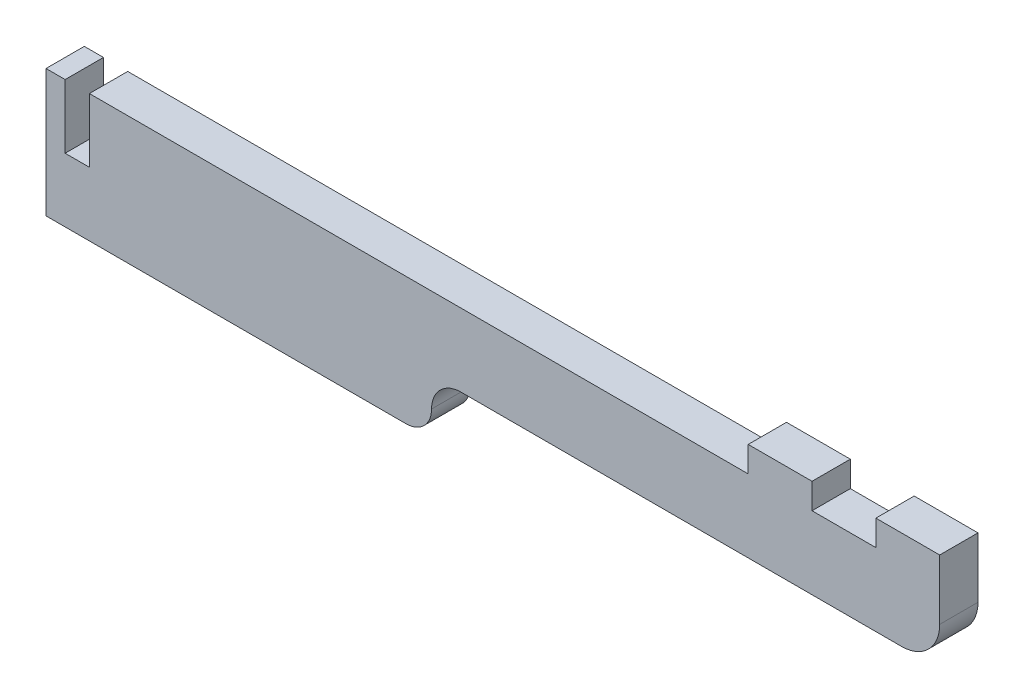
ISO-10303-21;
HEADER;
FILE_DESCRIPTION(('STEP AP214'),'2;1');
FILE_NAME('part.step','',(''),(''),'','','');
FILE_SCHEMA(('AUTOMOTIVE_DESIGN { 1 0 10303 214 1 1 1 1 }'));
ENDSEC;
DATA;
#1=APPLICATION_CONTEXT('core data for automotive mechanical design processes');
#2=APPLICATION_PROTOCOL_DEFINITION('international standard','automotive_design',2000,#1);
#3=PRODUCT_CONTEXT('',#1,'mechanical');
#4=PRODUCT('Part','Part','',(#3));
#5=PRODUCT_RELATED_PRODUCT_CATEGORY('part','',(#4));
#6=PRODUCT_DEFINITION_FORMATION('','',#4);
#7=PRODUCT_DEFINITION_CONTEXT('part definition',#1,'design');
#8=PRODUCT_DEFINITION('design','',#6,#7);
#9=PRODUCT_DEFINITION_SHAPE('','',#8);
#10=(LENGTH_UNIT() NAMED_UNIT(*) SI_UNIT(.MILLI.,.METRE.));
#11=(NAMED_UNIT(*) PLANE_ANGLE_UNIT() SI_UNIT($,.RADIAN.));
#12=(NAMED_UNIT(*) SI_UNIT($,.STERADIAN.) SOLID_ANGLE_UNIT());
#13=UNCERTAINTY_MEASURE_WITH_UNIT(LENGTH_MEASURE(1.E-05),#10,'distance_accuracy_value','');
#14=(GEOMETRIC_REPRESENTATION_CONTEXT(3) GLOBAL_UNCERTAINTY_ASSIGNED_CONTEXT((#13)) GLOBAL_UNIT_ASSIGNED_CONTEXT((#10,
#11,#12)) REPRESENTATION_CONTEXT('',''));
#15=CARTESIAN_POINT('',(0.,0.,0.));
#16=DIRECTION('',(0.,0.,1.));
#17=DIRECTION('',(1.,0.,0.));
#18=AXIS2_PLACEMENT_3D('',#15,#16,#17);
#19=CARTESIAN_POINT('',(0.,0.,6.));
#20=DIRECTION('',(0.,1.,0.));
#21=DIRECTION('',(0.,0.,1.));
#22=AXIS2_PLACEMENT_3D('',#19,#20,#21);
#23=PLANE('',#22);
#24=DIRECTION('',(0.,0.,1.));
#25=VECTOR('',#24,1.);
#26=CARTESIAN_POINT('',(56.4,0.,-0.00100000000000013));
#27=LINE('',#26,#25);
#28=CARTESIAN_POINT('',(56.4,0.,0.));
#29=VERTEX_POINT('',#28);
#30=CARTESIAN_POINT('',(56.4,0.,6.));
#31=VERTEX_POINT('',#30);
#32=EDGE_CURVE('E174',#29,#31,#27,.T.);
#33=ORIENTED_EDGE('',*,*,#32,.T.);
#34=DIRECTION('',(1.,0.,0.));
#35=VECTOR('',#34,1.);
#36=CARTESIAN_POINT('',(0.,0.,6.));
#37=LINE('',#36,#35);
#38=CARTESIAN_POINT('',(0.,0.,6.));
#39=VERTEX_POINT('',#38);
#40=EDGE_CURVE('E212',#39,#31,#37,.T.);
#41=ORIENTED_EDGE('',*,*,#40,.F.);
#42=DIRECTION('',(0.,0.,-1.));
#43=VECTOR('',#42,1.);
#44=CARTESIAN_POINT('',(0.,0.,6.));
#45=LINE('',#44,#43);
#46=CARTESIAN_POINT('',(0.,0.,0.));
#47=VERTEX_POINT('',#46);
#48=EDGE_CURVE('E11',#39,#47,#45,.T.);
#49=ORIENTED_EDGE('',*,*,#48,.T.);
#50=DIRECTION('',(1.,0.,0.));
#51=VECTOR('',#50,1.);
#52=CARTESIAN_POINT('',(0.,0.,0.));
#53=LINE('',#52,#51);
#54=EDGE_CURVE('E183',#47,#29,#53,.T.);
#55=ORIENTED_EDGE('',*,*,#54,.T.);
#56=EDGE_LOOP('',(#33,#41,#49,#55));
#57=FACE_BOUND('',#56,.T.);
#58=ADVANCED_FACE('F33',(#57),#23,.F.);
#59=CARTESIAN_POINT('',(0.,20.,6.));
#60=DIRECTION('',(0.,-1.,0.));
#61=DIRECTION('',(0.,0.,-1.));
#62=AXIS2_PLACEMENT_3D('',#59,#60,#61);
#63=PLANE('',#62);
#64=DIRECTION('',(-1.,0.,0.));
#65=VECTOR('',#64,1.);
#66=CARTESIAN_POINT('',(0.,20.,6.));
#67=LINE('',#66,#65);
#68=CARTESIAN_POINT('',(3.,20.,6.));
#69=VERTEX_POINT('',#68);
#70=CARTESIAN_POINT('',(0.,20.,6.));
#71=VERTEX_POINT('',#70);
#72=EDGE_CURVE('E203',#69,#71,#67,.T.);
#73=ORIENTED_EDGE('',*,*,#72,.F.);
#74=DIRECTION('',(0.,0.,-1.));
#75=VECTOR('',#74,1.);
#76=CARTESIAN_POINT('',(3.,20.,6.001));
#77=LINE('',#76,#75);
#78=CARTESIAN_POINT('',(3.,20.,0.));
#79=VERTEX_POINT('',#78);
#80=EDGE_CURVE('E260',#69,#79,#77,.T.);
#81=ORIENTED_EDGE('',*,*,#80,.T.);
#82=DIRECTION('',(-1.,0.,0.));
#83=VECTOR('',#82,1.);
#84=CARTESIAN_POINT('',(0.,20.,0.));
#85=LINE('',#84,#83);
#86=CARTESIAN_POINT('',(0.,20.,0.));
#87=VERTEX_POINT('',#86);
#88=EDGE_CURVE('E182',#79,#87,#85,.T.);
#89=ORIENTED_EDGE('',*,*,#88,.T.);
#90=DIRECTION('',(0.,0.,-1.));
#91=VECTOR('',#90,1.);
#92=CARTESIAN_POINT('',(0.,20.,6.));
#93=LINE('',#92,#91);
#94=EDGE_CURVE('E41',#71,#87,#93,.T.);
#95=ORIENTED_EDGE('',*,*,#94,.F.);
#96=EDGE_LOOP('',(#73,#81,#89,#95));
#97=FACE_BOUND('',#96,.T.);
#98=ADVANCED_FACE('F320',(#97),#63,.F.);
#99=CARTESIAN_POINT('',(130.,20.,0.));
#100=VERTEX_POINT('',#99);
#101=CARTESIAN_POINT('',(120.,20.,0.));
#102=VERTEX_POINT('',#101);
#103=EDGE_CURVE('E187',#100,#102,#85,.T.);
#104=ORIENTED_EDGE('',*,*,#103,.T.);
#105=DIRECTION('',(0.,0.,-1.));
#106=VECTOR('',#105,1.);
#107=CARTESIAN_POINT('',(120.,20.,16.770329614269));
#108=LINE('',#107,#106);
#109=CARTESIAN_POINT('',(120.,20.,6.));
#110=VERTEX_POINT('',#109);
#111=EDGE_CURVE('E233',#110,#102,#108,.T.);
#112=ORIENTED_EDGE('',*,*,#111,.F.);
#113=CARTESIAN_POINT('',(130.,20.,6.));
#114=VERTEX_POINT('',#113);
#115=EDGE_CURVE('E194',#114,#110,#67,.T.);
#116=ORIENTED_EDGE('',*,*,#115,.F.);
#117=DIRECTION('',(0.,0.,-1.));
#118=VECTOR('',#117,1.);
#119=CARTESIAN_POINT('',(130.,20.,16.770329614269));
#120=LINE('',#119,#118);
#121=EDGE_CURVE('E218',#114,#100,#120,.T.);
#122=ORIENTED_EDGE('',*,*,#121,.T.);
#123=EDGE_LOOP('',(#104,#112,#116,#122));
#124=FACE_BOUND('',#123,.T.);
#125=ADVANCED_FACE('F347',(#124),#63,.F.);
#126=CARTESIAN_POINT('',(0.,0.,6.));
#127=DIRECTION('',(1.,0.,0.));
#128=DIRECTION('',(0.,0.,-1.));
#129=AXIS2_PLACEMENT_3D('',#126,#127,#128);
#130=PLANE('',#129);
#131=DIRECTION('',(0.,-1.,0.));
#132=VECTOR('',#131,1.);
#133=CARTESIAN_POINT('',(0.,0.,0.));
#134=LINE('',#133,#132);
#135=EDGE_CURVE('E189',#87,#47,#134,.T.);
#136=ORIENTED_EDGE('',*,*,#135,.T.);
#137=ORIENTED_EDGE('',*,*,#48,.F.);
#138=DIRECTION('',(0.,-1.,0.));
#139=VECTOR('',#138,1.);
#140=CARTESIAN_POINT('',(0.,0.,6.));
#141=LINE('',#140,#139);
#142=EDGE_CURVE('E192',#71,#39,#141,.T.);
#143=ORIENTED_EDGE('',*,*,#142,.F.);
#144=ORIENTED_EDGE('',*,*,#94,.T.);
#145=EDGE_LOOP('',(#136,#137,#143,#144));
#146=FACE_BOUND('',#145,.T.);
#147=ADVANCED_FACE('F35',(#146),#130,.F.);
#148=CARTESIAN_POINT('',(140.,0.,6.));
#149=DIRECTION('',(-1.,0.,0.));
#150=DIRECTION('',(0.,0.,1.));
#151=AXIS2_PLACEMENT_3D('',#148,#149,#150);
#152=PLANE('',#151);
#153=DIRECTION('',(0.,1.,0.));
#154=VECTOR('',#153,1.);
#155=CARTESIAN_POINT('',(140.,0.,6.));
#156=LINE('',#155,#154);
#157=CARTESIAN_POINT('',(140.,14.5842325695984,6.));
#158=VERTEX_POINT('',#157);
#159=CARTESIAN_POINT('',(140.,24.,6.));
#160=VERTEX_POINT('',#159);
#161=EDGE_CURVE('E173',#158,#160,#156,.T.);
#162=ORIENTED_EDGE('',*,*,#161,.F.);
#163=DIRECTION('',(0.,0.,1.));
#164=VECTOR('',#163,1.);
#165=CARTESIAN_POINT('',(140.,14.5842325695984,-0.00100000000000013));
#166=LINE('',#165,#164);
#167=CARTESIAN_POINT('',(140.,14.5842325695984,0.));
#168=VERTEX_POINT('',#167);
#169=EDGE_CURVE('E160',#168,#158,#166,.T.);
#170=ORIENTED_EDGE('',*,*,#169,.F.);
#171=DIRECTION('',(0.,1.,0.));
#172=VECTOR('',#171,1.);
#173=CARTESIAN_POINT('',(140.,0.,0.));
#174=LINE('',#173,#172);
#175=CARTESIAN_POINT('',(140.,24.,0.));
#176=VERTEX_POINT('',#175);
#177=EDGE_CURVE('E171',#168,#176,#174,.T.);
#178=ORIENTED_EDGE('',*,*,#177,.T.);
#179=DIRECTION('',(0.,0.,-1.));
#180=VECTOR('',#179,1.);
#181=CARTESIAN_POINT('',(140.,24.,16.770329614269));
#182=LINE('',#181,#180);
#183=EDGE_CURVE('E223',#160,#176,#182,.T.);
#184=ORIENTED_EDGE('',*,*,#183,.F.);
#185=EDGE_LOOP('',(#162,#170,#178,#184));
#186=FACE_BOUND('',#185,.T.);
#187=ADVANCED_FACE('F169',(#186),#152,.F.);
#188=CARTESIAN_POINT('',(110.,20.,0.));
#189=VERTEX_POINT('',#188);
#190=CARTESIAN_POINT('',(6.8,20.,0.));
#191=VERTEX_POINT('',#190);
#192=EDGE_CURVE('E185',#189,#191,#85,.T.);
#193=ORIENTED_EDGE('',*,*,#192,.T.);
#194=DIRECTION('',(0.,0.,-1.));
#195=VECTOR('',#194,1.);
#196=CARTESIAN_POINT('',(6.8,20.,6.001));
#197=LINE('',#196,#195);
#198=CARTESIAN_POINT('',(6.8,20.,6.));
#199=VERTEX_POINT('',#198);
#200=EDGE_CURVE('E56',#199,#191,#197,.T.);
#201=ORIENTED_EDGE('',*,*,#200,.F.);
#202=CARTESIAN_POINT('',(110.,20.,6.));
#203=VERTEX_POINT('',#202);
#204=EDGE_CURVE('E201',#203,#199,#67,.T.);
#205=ORIENTED_EDGE('',*,*,#204,.F.);
#206=DIRECTION('',(0.,0.,-1.));
#207=VECTOR('',#206,1.);
#208=CARTESIAN_POINT('',(110.,20.,16.770329614269));
#209=LINE('',#208,#207);
#210=EDGE_CURVE('E236',#203,#189,#209,.T.);
#211=ORIENTED_EDGE('',*,*,#210,.T.);
#212=EDGE_LOOP('',(#193,#201,#205,#211));
#213=FACE_BOUND('',#212,.T.);
#214=ADVANCED_FACE('F330',(#213),#63,.F.);
#215=CARTESIAN_POINT('',(0.,0.,6.));
#216=DIRECTION('',(0.,0.,-1.));
#217=DIRECTION('',(-1.,0.,0.));
#218=AXIS2_PLACEMENT_3D('',#215,#216,#217);
#219=PLANE('',#218);
#220=ORIENTED_EDGE('',*,*,#40,.T.);
#221=CARTESIAN_POINT('',(56.4,4.,6.));
#222=DIRECTION('',(0.,0.,-1.));
#223=DIRECTION('',(1.,0.,0.));
#224=AXIS2_PLACEMENT_3D('',#221,#222,#223);
#225=CIRCLE('',#224,4.);
#226=CARTESIAN_POINT('',(60.4,4.,6.));
#227=VERTEX_POINT('',#226);
#228=EDGE_CURVE('E296',#227,#31,#225,.T.);
#229=ORIENTED_EDGE('',*,*,#228,.F.);
#230=CARTESIAN_POINT('',(65.,4.,6.));
#231=DIRECTION('',(0.,0.,1.));
#232=DIRECTION('',(-1.,0.,0.));
#233=AXIS2_PLACEMENT_3D('',#230,#231,#232);
#234=CIRCLE('',#233,4.59999999999999);
#235=CARTESIAN_POINT('',(65.,8.59999999999999,6.));
#236=VERTEX_POINT('',#235);
#237=EDGE_CURVE('E283',#236,#227,#234,.T.);
#238=ORIENTED_EDGE('',*,*,#237,.F.);
#239=DIRECTION('',(-1.,0.,0.));
#240=VECTOR('',#239,1.);
#241=CARTESIAN_POINT('',(134.015767430402,8.6,6.));
#242=LINE('',#241,#240);
#243=CARTESIAN_POINT('',(134.015767430402,8.6,6.));
#244=VERTEX_POINT('',#243);
#245=EDGE_CURVE('E291',#244,#236,#242,.T.);
#246=ORIENTED_EDGE('',*,*,#245,.F.);
#247=CARTESIAN_POINT('',(134.015767430402,14.5842325695984,6.));
#248=DIRECTION('',(0.,0.,-1.));
#249=DIRECTION('',(1.,0.,0.));
#250=AXIS2_PLACEMENT_3D('',#247,#248,#249);
#251=CIRCLE('',#250,5.9842325695984);
#252=EDGE_CURVE('E294',#158,#244,#251,.T.);
#253=ORIENTED_EDGE('',*,*,#252,.F.);
#254=ORIENTED_EDGE('',*,*,#161,.T.);
#255=DIRECTION('',(-1.,0.,0.));
#256=VECTOR('',#255,1.);
#257=CARTESIAN_POINT('',(140.,24.,6.));
#258=LINE('',#257,#256);
#259=CARTESIAN_POINT('',(130.,24.,6.));
#260=VERTEX_POINT('',#259);
#261=EDGE_CURVE('E230',#160,#260,#258,.T.);
#262=ORIENTED_EDGE('',*,*,#261,.T.);
#263=DIRECTION('',(0.,-1.,0.));
#264=VECTOR('',#263,1.);
#265=CARTESIAN_POINT('',(130.,20.,6.));
#266=LINE('',#265,#264);
#267=EDGE_CURVE('E225',#260,#114,#266,.T.);
#268=ORIENTED_EDGE('',*,*,#267,.T.);
#269=ORIENTED_EDGE('',*,*,#115,.T.);
#270=DIRECTION('',(0.,1.,0.));
#271=VECTOR('',#270,1.);
#272=CARTESIAN_POINT('',(120.,20.,6.));
#273=LINE('',#272,#271);
#274=CARTESIAN_POINT('',(120.,24.,6.));
#275=VERTEX_POINT('',#274);
#276=EDGE_CURVE('E229',#110,#275,#273,.T.);
#277=ORIENTED_EDGE('',*,*,#276,.T.);
#278=DIRECTION('',(-1.,0.,0.));
#279=VECTOR('',#278,1.);
#280=CARTESIAN_POINT('',(120.,24.,6.));
#281=LINE('',#280,#279);
#282=CARTESIAN_POINT('',(110.,24.,6.));
#283=VERTEX_POINT('',#282);
#284=EDGE_CURVE('E255',#275,#283,#281,.T.);
#285=ORIENTED_EDGE('',*,*,#284,.T.);
#286=DIRECTION('',(0.,-1.,0.));
#287=VECTOR('',#286,1.);
#288=CARTESIAN_POINT('',(110.,20.,6.));
#289=LINE('',#288,#287);
#290=EDGE_CURVE('E244',#283,#203,#289,.T.);
#291=ORIENTED_EDGE('',*,*,#290,.T.);
#292=ORIENTED_EDGE('',*,*,#204,.T.);
#293=DIRECTION('',(0.,1.,0.));
#294=VECTOR('',#293,1.);
#295=CARTESIAN_POINT('',(6.8,10.,6.));
#296=LINE('',#295,#294);
#297=CARTESIAN_POINT('',(6.8,10.,6.));
#298=VERTEX_POINT('',#297);
#299=EDGE_CURVE('E253',#298,#199,#296,.T.);
#300=ORIENTED_EDGE('',*,*,#299,.F.);
#301=DIRECTION('',(1.,0.,0.));
#302=VECTOR('',#301,1.);
#303=CARTESIAN_POINT('',(3.,10.,6.));
#304=LINE('',#303,#302);
#305=CARTESIAN_POINT('',(3.,10.,6.));
#306=VERTEX_POINT('',#305);
#307=EDGE_CURVE('E278',#306,#298,#304,.T.);
#308=ORIENTED_EDGE('',*,*,#307,.F.);
#309=DIRECTION('',(0.,-1.,0.));
#310=VECTOR('',#309,1.);
#311=CARTESIAN_POINT('',(3.,20.,6.));
#312=LINE('',#311,#310);
#313=EDGE_CURVE('E275',#69,#306,#312,.T.);
#314=ORIENTED_EDGE('',*,*,#313,.F.);
#315=ORIENTED_EDGE('',*,*,#72,.T.);
#316=ORIENTED_EDGE('',*,*,#142,.T.);
#317=EDGE_LOOP('',(#220,#229,#238,#246,#253,#254,#262,#268,#269,#277,#285,#291,#292,#300,#308,
#314,#315,#316));
#318=FACE_BOUND('',#317,.T.);
#319=ADVANCED_FACE('F324',(#318),#219,.F.);
#320=CARTESIAN_POINT('',(0.,0.,0.));
#321=DIRECTION('',(0.,0.,-1.));
#322=DIRECTION('',(-1.,0.,0.));
#323=AXIS2_PLACEMENT_3D('',#320,#321,#322);
#324=PLANE('',#323);
#325=CARTESIAN_POINT('',(56.4,4.,0.));
#326=DIRECTION('',(0.,0.,-1.));
#327=DIRECTION('',(-1.,0.,0.));
#328=AXIS2_PLACEMENT_3D('',#325,#326,#327);
#329=CIRCLE('',#328,4.);
#330=CARTESIAN_POINT('',(60.4,4.,0.));
#331=VERTEX_POINT('',#330);
#332=EDGE_CURVE('E298',#331,#29,#329,.T.);
#333=ORIENTED_EDGE('',*,*,#332,.T.);
#334=ORIENTED_EDGE('',*,*,#54,.F.);
#335=ORIENTED_EDGE('',*,*,#135,.F.);
#336=ORIENTED_EDGE('',*,*,#88,.F.);
#337=DIRECTION('',(0.,1.,0.));
#338=VECTOR('',#337,1.);
#339=CARTESIAN_POINT('',(3.,20.,0.));
#340=LINE('',#339,#338);
#341=CARTESIAN_POINT('',(3.,10.,0.));
#342=VERTEX_POINT('',#341);
#343=EDGE_CURVE('E263',#342,#79,#340,.T.);
#344=ORIENTED_EDGE('',*,*,#343,.F.);
#345=DIRECTION('',(-1.,0.,0.));
#346=VECTOR('',#345,1.);
#347=CARTESIAN_POINT('',(3.,10.,0.));
#348=LINE('',#347,#346);
#349=CARTESIAN_POINT('',(6.8,10.,0.));
#350=VERTEX_POINT('',#349);
#351=EDGE_CURVE('E270',#350,#342,#348,.T.);
#352=ORIENTED_EDGE('',*,*,#351,.F.);
#353=DIRECTION('',(0.,-1.,0.));
#354=VECTOR('',#353,1.);
#355=CARTESIAN_POINT('',(6.8,10.,0.));
#356=LINE('',#355,#354);
#357=EDGE_CURVE('E273',#191,#350,#356,.T.);
#358=ORIENTED_EDGE('',*,*,#357,.F.);
#359=ORIENTED_EDGE('',*,*,#192,.F.);
#360=DIRECTION('',(0.,1.,0.));
#361=VECTOR('',#360,1.);
#362=CARTESIAN_POINT('',(110.,20.,0.));
#363=LINE('',#362,#361);
#364=CARTESIAN_POINT('',(110.,24.,0.));
#365=VERTEX_POINT('',#364);
#366=EDGE_CURVE('E247',#189,#365,#363,.T.);
#367=ORIENTED_EDGE('',*,*,#366,.T.);
#368=DIRECTION('',(1.,0.,0.));
#369=VECTOR('',#368,1.);
#370=CARTESIAN_POINT('',(120.,24.,0.));
#371=LINE('',#370,#369);
#372=CARTESIAN_POINT('',(120.,24.,0.));
#373=VERTEX_POINT('',#372);
#374=EDGE_CURVE('E237',#365,#373,#371,.T.);
#375=ORIENTED_EDGE('',*,*,#374,.T.);
#376=DIRECTION('',(0.,-1.,0.));
#377=VECTOR('',#376,1.);
#378=CARTESIAN_POINT('',(120.,20.,0.));
#379=LINE('',#378,#377);
#380=EDGE_CURVE('E250',#373,#102,#379,.T.);
#381=ORIENTED_EDGE('',*,*,#380,.T.);
#382=ORIENTED_EDGE('',*,*,#103,.F.);
#383=DIRECTION('',(0.,1.,0.));
#384=VECTOR('',#383,1.);
#385=CARTESIAN_POINT('',(130.,20.,0.));
#386=LINE('',#385,#384);
#387=CARTESIAN_POINT('',(130.,24.,0.));
#388=VERTEX_POINT('',#387);
#389=EDGE_CURVE('E227',#100,#388,#386,.T.);
#390=ORIENTED_EDGE('',*,*,#389,.T.);
#391=DIRECTION('',(1.,0.,0.));
#392=VECTOR('',#391,1.);
#393=CARTESIAN_POINT('',(140.,24.,0.));
#394=LINE('',#393,#392);
#395=EDGE_CURVE('E181',#388,#176,#394,.T.);
#396=ORIENTED_EDGE('',*,*,#395,.T.);
#397=ORIENTED_EDGE('',*,*,#177,.F.);
#398=CARTESIAN_POINT('',(134.015767430402,14.5842325695984,0.));
#399=DIRECTION('',(0.,0.,-1.));
#400=DIRECTION('',(-1.,0.,0.));
#401=AXIS2_PLACEMENT_3D('',#398,#399,#400);
#402=CIRCLE('',#401,5.9842325695984);
#403=CARTESIAN_POINT('',(134.015767430402,8.6,0.));
#404=VERTEX_POINT('',#403);
#405=EDGE_CURVE('E157',#168,#404,#402,.T.);
#406=ORIENTED_EDGE('',*,*,#405,.T.);
#407=DIRECTION('',(-1.,0.,0.));
#408=VECTOR('',#407,1.);
#409=CARTESIAN_POINT('',(134.015767430402,8.6,0.));
#410=LINE('',#409,#408);
#411=CARTESIAN_POINT('',(65.,8.59999999999999,0.));
#412=VERTEX_POINT('',#411);
#413=EDGE_CURVE('E165',#404,#412,#410,.T.);
#414=ORIENTED_EDGE('',*,*,#413,.T.);
#415=CARTESIAN_POINT('',(65.,4.,0.));
#416=DIRECTION('',(0.,0.,-1.));
#417=DIRECTION('',(-1.,0.,0.));
#418=AXIS2_PLACEMENT_3D('',#415,#416,#417);
#419=CIRCLE('',#418,4.59999999999999);
#420=EDGE_CURVE('E300',#412,#331,#419,.F.);
#421=ORIENTED_EDGE('',*,*,#420,.T.);
#422=EDGE_LOOP('',(#333,#334,#335,#336,#344,#352,#358,#359,#367,#375,#381,#382,#390,#396,#397,
#406,#414,#421));
#423=FACE_BOUND('',#422,.T.);
#424=ADVANCED_FACE('F178',(#423),#324,.T.);
#425=CARTESIAN_POINT('',(140.,24.,16.770329614269));
#426=DIRECTION('',(0.,1.,0.));
#427=DIRECTION('',(0.,0.,1.));
#428=AXIS2_PLACEMENT_3D('',#425,#426,#427);
#429=PLANE('',#428);
#430=ORIENTED_EDGE('',*,*,#261,.F.);
#431=ORIENTED_EDGE('',*,*,#183,.T.);
#432=ORIENTED_EDGE('',*,*,#395,.F.);
#433=DIRECTION('',(0.,0.,-1.));
#434=VECTOR('',#433,1.);
#435=CARTESIAN_POINT('',(130.,24.,16.770329614269));
#436=LINE('',#435,#434);
#437=EDGE_CURVE('E221',#260,#388,#436,.T.);
#438=ORIENTED_EDGE('',*,*,#437,.F.);
#439=EDGE_LOOP('',(#430,#431,#432,#438));
#440=FACE_BOUND('',#439,.T.);
#441=ADVANCED_FACE('F354',(#440),#429,.T.);
#442=CARTESIAN_POINT('',(130.,20.,16.770329614269));
#443=DIRECTION('',(-1.,0.,0.));
#444=DIRECTION('',(0.,0.,1.));
#445=AXIS2_PLACEMENT_3D('',#442,#443,#444);
#446=PLANE('',#445);
#447=ORIENTED_EDGE('',*,*,#267,.F.);
#448=ORIENTED_EDGE('',*,*,#437,.T.);
#449=ORIENTED_EDGE('',*,*,#389,.F.);
#450=ORIENTED_EDGE('',*,*,#121,.F.);
#451=EDGE_LOOP('',(#447,#448,#449,#450));
#452=FACE_BOUND('',#451,.T.);
#453=ADVANCED_FACE('F351',(#452),#446,.T.);
#454=CARTESIAN_POINT('',(120.,20.,16.770329614269));
#455=DIRECTION('',(1.,0.,0.));
#456=DIRECTION('',(0.,0.,-1.));
#457=AXIS2_PLACEMENT_3D('',#454,#455,#456);
#458=PLANE('',#457);
#459=ORIENTED_EDGE('',*,*,#276,.F.);
#460=ORIENTED_EDGE('',*,*,#111,.T.);
#461=ORIENTED_EDGE('',*,*,#380,.F.);
#462=DIRECTION('',(0.,0.,-1.));
#463=VECTOR('',#462,1.);
#464=CARTESIAN_POINT('',(120.,24.,16.770329614269));
#465=LINE('',#464,#463);
#466=EDGE_CURVE('E242',#275,#373,#465,.T.);
#467=ORIENTED_EDGE('',*,*,#466,.F.);
#468=EDGE_LOOP('',(#459,#460,#461,#467));
#469=FACE_BOUND('',#468,.T.);
#470=ADVANCED_FACE('F344',(#469),#458,.T.);
#471=CARTESIAN_POINT('',(120.,24.,16.770329614269));
#472=DIRECTION('',(0.,1.,0.));
#473=DIRECTION('',(0.,0.,1.));
#474=AXIS2_PLACEMENT_3D('',#471,#472,#473);
#475=PLANE('',#474);
#476=ORIENTED_EDGE('',*,*,#284,.F.);
#477=ORIENTED_EDGE('',*,*,#466,.T.);
#478=ORIENTED_EDGE('',*,*,#374,.F.);
#479=DIRECTION('',(0.,0.,-1.));
#480=VECTOR('',#479,1.);
#481=CARTESIAN_POINT('',(110.,24.,16.770329614269));
#482=LINE('',#481,#480);
#483=EDGE_CURVE('E240',#283,#365,#482,.T.);
#484=ORIENTED_EDGE('',*,*,#483,.F.);
#485=EDGE_LOOP('',(#476,#477,#478,#484));
#486=FACE_BOUND('',#485,.T.);
#487=ADVANCED_FACE('F340',(#486),#475,.T.);
#488=CARTESIAN_POINT('',(110.,20.,16.770329614269));
#489=DIRECTION('',(-1.,0.,0.));
#490=DIRECTION('',(0.,0.,1.));
#491=AXIS2_PLACEMENT_3D('',#488,#489,#490);
#492=PLANE('',#491);
#493=ORIENTED_EDGE('',*,*,#290,.F.);
#494=ORIENTED_EDGE('',*,*,#483,.T.);
#495=ORIENTED_EDGE('',*,*,#366,.F.);
#496=ORIENTED_EDGE('',*,*,#210,.F.);
#497=EDGE_LOOP('',(#493,#494,#495,#496));
#498=FACE_BOUND('',#497,.T.);
#499=ADVANCED_FACE('F335',(#498),#492,.T.);
#500=CARTESIAN_POINT('',(3.,20.,6.001));
#501=DIRECTION('',(-1.,0.,0.));
#502=DIRECTION('',(0.,-1.,0.));
#503=AXIS2_PLACEMENT_3D('',#500,#501,#502);
#504=PLANE('',#503);
#505=ORIENTED_EDGE('',*,*,#313,.T.);
#506=DIRECTION('',(0.,0.,-1.));
#507=VECTOR('',#506,1.);
#508=CARTESIAN_POINT('',(3.,10.,6.001));
#509=LINE('',#508,#507);
#510=EDGE_CURVE('E265',#306,#342,#509,.T.);
#511=ORIENTED_EDGE('',*,*,#510,.T.);
#512=ORIENTED_EDGE('',*,*,#343,.T.);
#513=ORIENTED_EDGE('',*,*,#80,.F.);
#514=EDGE_LOOP('',(#505,#511,#512,#513));
#515=FACE_BOUND('',#514,.T.);
#516=ADVANCED_FACE('F322',(#515),#504,.F.);
#517=CARTESIAN_POINT('',(3.,10.,6.001));
#518=DIRECTION('',(0.,-1.,0.));
#519=DIRECTION('',(1.,0.,0.));
#520=AXIS2_PLACEMENT_3D('',#517,#518,#519);
#521=PLANE('',#520);
#522=ORIENTED_EDGE('',*,*,#307,.T.);
#523=DIRECTION('',(0.,0.,-1.));
#524=VECTOR('',#523,1.);
#525=CARTESIAN_POINT('',(6.8,10.,6.001));
#526=LINE('',#525,#524);
#527=EDGE_CURVE('E262',#298,#350,#526,.T.);
#528=ORIENTED_EDGE('',*,*,#527,.T.);
#529=ORIENTED_EDGE('',*,*,#351,.T.);
#530=ORIENTED_EDGE('',*,*,#510,.F.);
#531=EDGE_LOOP('',(#522,#528,#529,#530));
#532=FACE_BOUND('',#531,.T.);
#533=ADVANCED_FACE('F327',(#532),#521,.F.);
#534=CARTESIAN_POINT('',(6.8,10.,6.001));
#535=DIRECTION('',(1.,0.,0.));
#536=DIRECTION('',(0.,1.,0.));
#537=AXIS2_PLACEMENT_3D('',#534,#535,#536);
#538=PLANE('',#537);
#539=ORIENTED_EDGE('',*,*,#299,.T.);
#540=ORIENTED_EDGE('',*,*,#200,.T.);
#541=ORIENTED_EDGE('',*,*,#357,.T.);
#542=ORIENTED_EDGE('',*,*,#527,.F.);
#543=EDGE_LOOP('',(#539,#540,#541,#542));
#544=FACE_BOUND('',#543,.T.);
#545=ADVANCED_FACE('F394',(#544),#538,.F.);
#546=CARTESIAN_POINT('',(56.4,4.,-0.00100000000000013));
#547=DIRECTION('',(0.,0.,1.));
#548=DIRECTION('',(1.,0.,0.));
#549=AXIS2_PLACEMENT_3D('',#546,#547,#548);
#550=CYLINDRICAL_SURFACE('',#549,4.);
#551=DIRECTION('',(0.,0.,1.));
#552=VECTOR('',#551,1.);
#553=CARTESIAN_POINT('',(60.4,4.,-0.00100000000000013));
#554=LINE('',#553,#552);
#555=EDGE_CURVE('E281',#331,#227,#554,.T.);
#556=ORIENTED_EDGE('',*,*,#555,.T.);
#557=ORIENTED_EDGE('',*,*,#228,.T.);
#558=ORIENTED_EDGE('',*,*,#32,.F.);
#559=ORIENTED_EDGE('',*,*,#332,.F.);
#560=EDGE_LOOP('',(#556,#557,#558,#559));
#561=FACE_BOUND('',#560,.T.);
#562=ADVANCED_FACE('F313',(#561),#550,.T.);
#563=CARTESIAN_POINT('',(65.,4.,-0.00100000000000013));
#564=DIRECTION('',(0.,0.,1.));
#565=DIRECTION('',(1.,0.,0.));
#566=AXIS2_PLACEMENT_3D('',#563,#564,#565);
#567=CYLINDRICAL_SURFACE('',#566,4.59999999999999);
#568=DIRECTION('',(0.,0.,1.));
#569=VECTOR('',#568,1.);
#570=CARTESIAN_POINT('',(65.,8.59999999999999,-0.00100000000000013));
#571=LINE('',#570,#569);
#572=EDGE_CURVE('E286',#412,#236,#571,.T.);
#573=ORIENTED_EDGE('',*,*,#572,.T.);
#574=ORIENTED_EDGE('',*,*,#237,.T.);
#575=ORIENTED_EDGE('',*,*,#555,.F.);
#576=ORIENTED_EDGE('',*,*,#420,.F.);
#577=EDGE_LOOP('',(#573,#574,#575,#576));
#578=FACE_BOUND('',#577,.T.);
#579=ADVANCED_FACE('F309',(#578),#567,.F.);
#580=CARTESIAN_POINT('',(134.015767430402,8.6,-0.00100000000000013));
#581=DIRECTION('',(0.,1.,0.));
#582=DIRECTION('',(-1.,0.,0.));
#583=AXIS2_PLACEMENT_3D('',#580,#581,#582);
#584=PLANE('',#583);
#585=DIRECTION('',(0.,0.,1.));
#586=VECTOR('',#585,1.);
#587=CARTESIAN_POINT('',(134.015767430402,8.6,-0.00100000000000013));
#588=LINE('',#587,#586);
#589=EDGE_CURVE('E48',#404,#244,#588,.T.);
#590=ORIENTED_EDGE('',*,*,#589,.T.);
#591=ORIENTED_EDGE('',*,*,#245,.T.);
#592=ORIENTED_EDGE('',*,*,#572,.F.);
#593=ORIENTED_EDGE('',*,*,#413,.F.);
#594=EDGE_LOOP('',(#590,#591,#592,#593));
#595=FACE_BOUND('',#594,.T.);
#596=ADVANCED_FACE('F305',(#595),#584,.F.);
#597=CARTESIAN_POINT('',(134.015767430402,14.5842325695984,-0.00100000000000013));
#598=DIRECTION('',(0.,0.,1.));
#599=DIRECTION('',(1.,0.,0.));
#600=AXIS2_PLACEMENT_3D('',#597,#598,#599);
#601=CYLINDRICAL_SURFACE('',#600,5.9842325695984);
#602=ORIENTED_EDGE('',*,*,#169,.T.);
#603=ORIENTED_EDGE('',*,*,#252,.T.);
#604=ORIENTED_EDGE('',*,*,#589,.F.);
#605=ORIENTED_EDGE('',*,*,#405,.F.);
#606=EDGE_LOOP('',(#602,#603,#604,#605));
#607=FACE_BOUND('',#606,.T.);
#608=ADVANCED_FACE('F159',(#607),#601,.T.);
#609=CLOSED_SHELL('',(#58,#98,#125,#147,#187,#214,#319,#424,#441,#453,#470,#487,#499,#516,#533,
#545,#562,#579,#596,#608));
#610=MANIFOLD_SOLID_BREP('B2',#609);
#611=ADVANCED_BREP_SHAPE_REPRESENTATION('',(#18,#610),#14);
#612=SHAPE_DEFINITION_REPRESENTATION(#9,#611);
ENDSEC;
END-ISO-10303-21;
